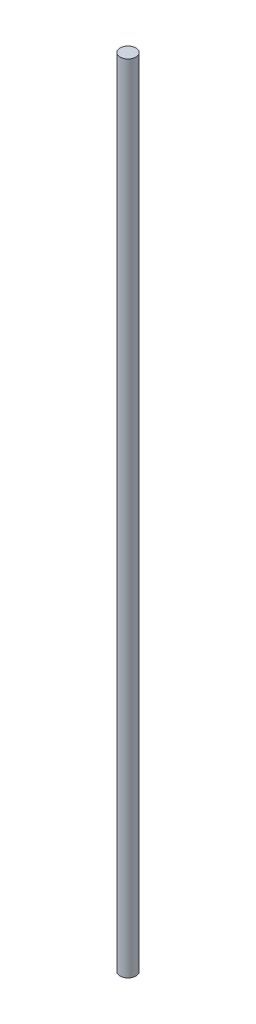
ISO-10303-21;
HEADER;
FILE_DESCRIPTION(('STEP AP214'),'2;1');
FILE_NAME('part.step','',(''),(''),'','','');
FILE_SCHEMA(('AUTOMOTIVE_DESIGN { 1 0 10303 214 1 1 1 1 }'));
ENDSEC;
DATA;
#1=APPLICATION_CONTEXT('core data for automotive mechanical design processes');
#2=APPLICATION_PROTOCOL_DEFINITION('international standard','automotive_design',2000,#1);
#3=PRODUCT_CONTEXT('',#1,'mechanical');
#4=PRODUCT('Part','Part','',(#3));
#5=PRODUCT_RELATED_PRODUCT_CATEGORY('part','',(#4));
#6=PRODUCT_DEFINITION_FORMATION('','',#4);
#7=PRODUCT_DEFINITION_CONTEXT('part definition',#1,'design');
#8=PRODUCT_DEFINITION('design','',#6,#7);
#9=PRODUCT_DEFINITION_SHAPE('','',#8);
#10=(LENGTH_UNIT() NAMED_UNIT(*) SI_UNIT(.MILLI.,.METRE.));
#11=(NAMED_UNIT(*) PLANE_ANGLE_UNIT() SI_UNIT($,.RADIAN.));
#12=(NAMED_UNIT(*) SI_UNIT($,.STERADIAN.) SOLID_ANGLE_UNIT());
#13=UNCERTAINTY_MEASURE_WITH_UNIT(LENGTH_MEASURE(1.E-05),#10,'distance_accuracy_value','');
#14=(GEOMETRIC_REPRESENTATION_CONTEXT(3) GLOBAL_UNCERTAINTY_ASSIGNED_CONTEXT((#13)) GLOBAL_UNIT_ASSIGNED_CONTEXT((#10,
#11,#12)) REPRESENTATION_CONTEXT('',''));
#15=CARTESIAN_POINT('',(0.,0.,0.));
#16=DIRECTION('',(0.,0.,1.));
#17=DIRECTION('',(1.,0.,0.));
#18=AXIS2_PLACEMENT_3D('',#15,#16,#17);
#19=CARTESIAN_POINT('',(0.,250.,0.));
#20=DIRECTION('',(0.,-1.,0.));
#21=DIRECTION('',(0.,0.,-1.));
#22=AXIS2_PLACEMENT_3D('',#19,#20,#21);
#23=CYLINDRICAL_SURFACE('',#22,2.5);
#24=CARTESIAN_POINT('',(0.,250.,0.));
#25=DIRECTION('',(0.,1.,0.));
#26=DIRECTION('',(0.,0.,1.));
#27=AXIS2_PLACEMENT_3D('',#24,#25,#26);
#28=CIRCLE('',#27,2.5);
#29=CARTESIAN_POINT('',(0.,250.,2.5));
#30=VERTEX_POINT('',#29);
#31=EDGE_CURVE('E10',#30,#30,#28,.T.);
#32=ORIENTED_EDGE('',*,*,#31,.F.);
#33=EDGE_LOOP('',(#32));
#34=FACE_BOUND('',#33,.T.);
#35=CARTESIAN_POINT('',(0.,0.,0.));
#36=DIRECTION('',(0.,1.,0.));
#37=DIRECTION('',(0.,0.,1.));
#38=AXIS2_PLACEMENT_3D('',#35,#36,#37);
#39=CIRCLE('',#38,2.5);
#40=CARTESIAN_POINT('',(0.,0.,2.5));
#41=VERTEX_POINT('',#40);
#42=EDGE_CURVE('E31',#41,#41,#39,.T.);
#43=ORIENTED_EDGE('',*,*,#42,.T.);
#44=EDGE_LOOP('',(#43));
#45=FACE_BOUND('',#44,.T.);
#46=ADVANCED_FACE('F28',(#34,#45),#23,.T.);
#47=CARTESIAN_POINT('',(0.,250.,0.));
#48=DIRECTION('',(0.,1.,0.));
#49=DIRECTION('',(0.,0.,1.));
#50=AXIS2_PLACEMENT_3D('',#47,#48,#49);
#51=PLANE('',#50);
#52=ORIENTED_EDGE('',*,*,#31,.T.);
#53=EDGE_LOOP('',(#52));
#54=FACE_BOUND('',#53,.T.);
#55=ADVANCED_FACE('F43',(#54),#51,.T.);
#56=CARTESIAN_POINT('',(0.,0.,0.));
#57=DIRECTION('',(0.,1.,0.));
#58=DIRECTION('',(0.,0.,1.));
#59=AXIS2_PLACEMENT_3D('',#56,#57,#58);
#60=PLANE('',#59);
#61=ORIENTED_EDGE('',*,*,#42,.F.);
#62=EDGE_LOOP('',(#61));
#63=FACE_BOUND('',#62,.T.);
#64=ADVANCED_FACE('F41',(#63),#60,.F.);
#65=CLOSED_SHELL('',(#46,#55,#64));
#66=MANIFOLD_SOLID_BREP('B2',#65);
#67=ADVANCED_BREP_SHAPE_REPRESENTATION('',(#18,#66),#14);
#68=SHAPE_DEFINITION_REPRESENTATION(#9,#67);
ENDSEC;
END-ISO-10303-21;
